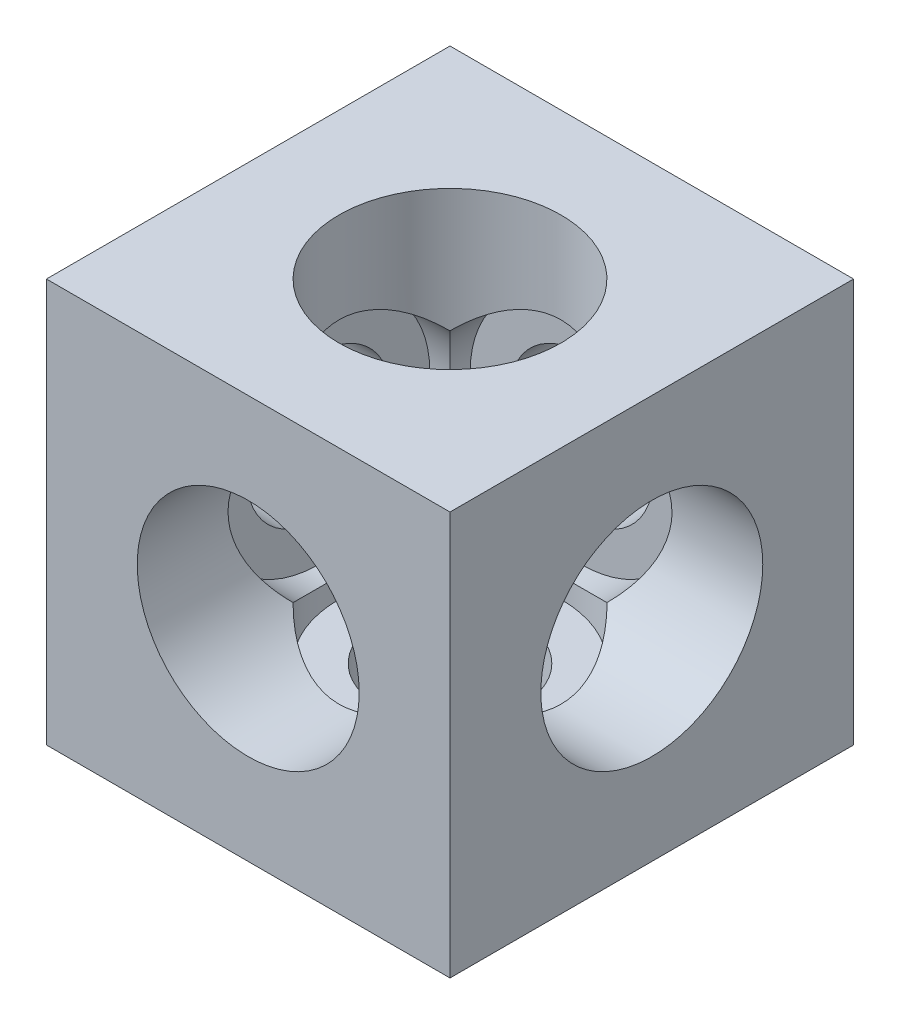
ISO-10303-21;
HEADER;
FILE_DESCRIPTION(('STEP AP214'),'2;1');
FILE_NAME('part.step','',(''),(''),'','','');
FILE_SCHEMA(('AUTOMOTIVE_DESIGN { 1 0 10303 214 1 1 1 1 }'));
ENDSEC;
DATA;
#1=APPLICATION_CONTEXT('core data for automotive mechanical design processes');
#2=APPLICATION_PROTOCOL_DEFINITION('international standard','automotive_design',2000,#1);
#3=PRODUCT_CONTEXT('',#1,'mechanical');
#4=PRODUCT('Part','Part','',(#3));
#5=PRODUCT_RELATED_PRODUCT_CATEGORY('part','',(#4));
#6=PRODUCT_DEFINITION_FORMATION('','',#4);
#7=PRODUCT_DEFINITION_CONTEXT('part definition',#1,'design');
#8=PRODUCT_DEFINITION('design','',#6,#7);
#9=PRODUCT_DEFINITION_SHAPE('','',#8);
#10=(LENGTH_UNIT() NAMED_UNIT(*) SI_UNIT(.MILLI.,.METRE.));
#11=(NAMED_UNIT(*) PLANE_ANGLE_UNIT() SI_UNIT($,.RADIAN.));
#12=(NAMED_UNIT(*) SI_UNIT($,.STERADIAN.) SOLID_ANGLE_UNIT());
#13=UNCERTAINTY_MEASURE_WITH_UNIT(LENGTH_MEASURE(1.E-05),#10,'distance_accuracy_value','');
#14=(GEOMETRIC_REPRESENTATION_CONTEXT(3) GLOBAL_UNCERTAINTY_ASSIGNED_CONTEXT((#13)) GLOBAL_UNIT_ASSIGNED_CONTEXT((#10,
#11,#12)) REPRESENTATION_CONTEXT('',''));
#15=CARTESIAN_POINT('',(0.,0.,0.));
#16=DIRECTION('',(0.,0.,1.));
#17=DIRECTION('',(1.,0.,0.));
#18=AXIS2_PLACEMENT_3D('',#15,#16,#17);
#19=CARTESIAN_POINT('',(0.,-10.,0.));
#20=DIRECTION('',(0.,1.,0.));
#21=DIRECTION('',(0.,0.,1.));
#22=AXIS2_PLACEMENT_3D('',#19,#20,#21);
#23=CYLINDRICAL_SURFACE('',#22,3.57);
#24=CARTESIAN_POINT('',(0.,-10.,0.));
#25=DIRECTION('',(0.,1.,0.));
#26=DIRECTION('',(0.,0.,1.));
#27=AXIS2_PLACEMENT_3D('',#24,#25,#26);
#28=CIRCLE('',#27,3.57);
#29=CARTESIAN_POINT('',(0.,-10.,3.57));
#30=VERTEX_POINT('',#29);
#31=EDGE_CURVE('E155',#30,#30,#28,.T.);
#32=ORIENTED_EDGE('',*,*,#31,.F.);
#33=EDGE_LOOP('',(#32));
#34=FACE_BOUND('',#33,.T.);
#35=CARTESIAN_POINT('',(0.,-6.50000000000001,0.));
#36=DIRECTION('',(0.,1.,0.));
#37=DIRECTION('',(-1.,0.,0.));
#38=AXIS2_PLACEMENT_3D('',#35,#36,#37);
#39=CIRCLE('',#38,3.57);
#40=CARTESIAN_POINT('',(-3.57,-6.50000000000001,0.));
#41=VERTEX_POINT('',#40);
#42=EDGE_CURVE('E133',#41,#41,#39,.F.);
#43=ORIENTED_EDGE('',*,*,#42,.F.);
#44=EDGE_LOOP('',(#43));
#45=FACE_BOUND('',#44,.T.);
#46=ADVANCED_FACE('F38',(#34,#45),#23,.F.);
#47=CARTESIAN_POINT('',(0.,0.,-25.556349186104));
#48=DIRECTION('',(0.,0.,1.));
#49=DIRECTION('',(1.,0.,0.));
#50=AXIS2_PLACEMENT_3D('',#47,#48,#49);
#51=CYLINDRICAL_SURFACE('',#50,5.5);
#52=CARTESIAN_POINT('',(0.,0.,10.));
#53=DIRECTION('',(0.,0.,1.));
#54=DIRECTION('',(1.,0.,0.));
#55=AXIS2_PLACEMENT_3D('',#52,#53,#54);
#56=CIRCLE('',#55,5.5);
#57=CARTESIAN_POINT('',(5.5,0.,10.));
#58=VERTEX_POINT('',#57);
#59=EDGE_CURVE('E169',#58,#58,#56,.T.);
#60=ORIENTED_EDGE('',*,*,#59,.T.);
#61=EDGE_LOOP('',(#60));
#62=FACE_BOUND('',#61,.T.);
#63=CARTESIAN_POINT('',(0.,0.,0.));
#64=DIRECTION('',(-0.707106781186547,0.,0.707106781186547));
#65=DIRECTION('',(0.707106781186547,0.,0.707106781186547));
#66=AXIS2_PLACEMENT_3D('',#63,#64,#65);
#67=ELLIPSE('',#66,7.77817459305202,5.5);
#68=CARTESIAN_POINT('',(3.88908729652601,3.88908729652601,3.88908729652601));
#69=VERTEX_POINT('',#68);
#70=CARTESIAN_POINT('',(3.88908729652601,-3.88908729652601,3.88908729652601));
#71=VERTEX_POINT('',#70);
#72=EDGE_CURVE('E112',#69,#71,#67,.F.);
#73=ORIENTED_EDGE('',*,*,#72,.T.);
#74=CARTESIAN_POINT('',(0.,0.,0.));
#75=DIRECTION('',(0.,0.707106781186547,0.707106781186547));
#76=DIRECTION('',(0.,-0.707106781186547,0.707106781186547));
#77=AXIS2_PLACEMENT_3D('',#74,#75,#76);
#78=ELLIPSE('',#77,7.77817459305202,5.5);
#79=CARTESIAN_POINT('',(-3.88908729652601,-3.88908729652601,3.88908729652601));
#80=VERTEX_POINT('',#79);
#81=EDGE_CURVE('E53',#71,#80,#78,.F.);
#82=ORIENTED_EDGE('',*,*,#81,.T.);
#83=CARTESIAN_POINT('',(0.,0.,0.));
#84=DIRECTION('',(0.707106781186547,0.,0.707106781186547));
#85=DIRECTION('',(-0.707106781186547,0.,0.707106781186547));
#86=AXIS2_PLACEMENT_3D('',#83,#84,#85);
#87=ELLIPSE('',#86,7.77817459305202,5.5);
#88=CARTESIAN_POINT('',(-3.88908729652601,3.88908729652601,3.88908729652601));
#89=VERTEX_POINT('',#88);
#90=EDGE_CURVE('E107',#80,#89,#87,.F.);
#91=ORIENTED_EDGE('',*,*,#90,.T.);
#92=CARTESIAN_POINT('',(0.,0.,0.));
#93=DIRECTION('',(0.,-0.707106781186547,0.707106781186547));
#94=DIRECTION('',(0.,0.707106781186547,0.707106781186547));
#95=AXIS2_PLACEMENT_3D('',#92,#93,#94);
#96=ELLIPSE('',#95,7.77817459305202,5.5);
#97=EDGE_CURVE('E101',#89,#69,#96,.F.);
#98=ORIENTED_EDGE('',*,*,#97,.T.);
#99=EDGE_LOOP('',(#73,#82,#91,#98));
#100=FACE_BOUND('',#99,.T.);
#101=ADVANCED_FACE('F111',(#62,#100),#51,.F.);
#102=CARTESIAN_POINT('',(-10.,0.,0.));
#103=DIRECTION('',(1.,0.,0.));
#104=DIRECTION('',(0.,0.,-1.));
#105=AXIS2_PLACEMENT_3D('',#102,#103,#104);
#106=CYLINDRICAL_SURFACE('',#105,3.57);
#107=CARTESIAN_POINT('',(-10.,0.,0.));
#108=DIRECTION('',(1.,0.,0.));
#109=DIRECTION('',(0.,0.,-1.));
#110=AXIS2_PLACEMENT_3D('',#107,#108,#109);
#111=CIRCLE('',#110,3.57);
#112=CARTESIAN_POINT('',(-10.,0.,-3.57));
#113=VERTEX_POINT('',#112);
#114=EDGE_CURVE('E165',#113,#113,#111,.T.);
#115=ORIENTED_EDGE('',*,*,#114,.F.);
#116=EDGE_LOOP('',(#115));
#117=FACE_BOUND('',#116,.T.);
#118=CARTESIAN_POINT('',(-6.5,0.,0.));
#119=DIRECTION('',(1.,0.,0.));
#120=DIRECTION('',(0.,0.,-1.));
#121=AXIS2_PLACEMENT_3D('',#118,#119,#120);
#122=CIRCLE('',#121,3.57);
#123=CARTESIAN_POINT('',(-6.5,0.,-3.57));
#124=VERTEX_POINT('',#123);
#125=EDGE_CURVE('E128',#124,#124,#122,.F.);
#126=ORIENTED_EDGE('',*,*,#125,.F.);
#127=EDGE_LOOP('',(#126));
#128=FACE_BOUND('',#127,.T.);
#129=ADVANCED_FACE('F233',(#117,#128),#106,.F.);
#130=CARTESIAN_POINT('',(9.99999999999999,-10.,10.));
#131=DIRECTION('',(-1.,0.,0.));
#132=DIRECTION('',(0.,0.,1.));
#133=AXIS2_PLACEMENT_3D('',#130,#131,#132);
#134=PLANE('',#133);
#135=CARTESIAN_POINT('',(9.99999999999999,0.,0.));
#136=DIRECTION('',(1.,0.,0.));
#137=DIRECTION('',(0.,0.,-1.));
#138=AXIS2_PLACEMENT_3D('',#135,#136,#137);
#139=CIRCLE('',#138,5.5);
#140=CARTESIAN_POINT('',(9.99999999999999,0.,-5.5));
#141=VERTEX_POINT('',#140);
#142=EDGE_CURVE('E158',#141,#141,#139,.T.);
#143=ORIENTED_EDGE('',*,*,#142,.F.);
#144=EDGE_LOOP('',(#143));
#145=FACE_BOUND('',#144,.T.);
#146=DIRECTION('',(0.,1.,0.));
#147=VECTOR('',#146,1.);
#148=CARTESIAN_POINT('',(9.99999999999999,-10.,-10.));
#149=LINE('',#148,#147);
#150=CARTESIAN_POINT('',(9.99999999999999,-10.,-10.));
#151=VERTEX_POINT('',#150);
#152=CARTESIAN_POINT('',(9.99999999999999,9.99999999999999,-10.));
#153=VERTEX_POINT('',#152);
#154=EDGE_CURVE('E181',#151,#153,#149,.T.);
#155=ORIENTED_EDGE('',*,*,#154,.T.);
#156=DIRECTION('',(0.,0.,-1.));
#157=VECTOR('',#156,1.);
#158=CARTESIAN_POINT('',(9.99999999999999,9.99999999999999,10.));
#159=LINE('',#158,#157);
#160=CARTESIAN_POINT('',(9.99999999999999,9.99999999999999,10.));
#161=VERTEX_POINT('',#160);
#162=EDGE_CURVE('E118',#161,#153,#159,.T.);
#163=ORIENTED_EDGE('',*,*,#162,.F.);
#164=DIRECTION('',(0.,1.,0.));
#165=VECTOR('',#164,1.);
#166=CARTESIAN_POINT('',(9.99999999999999,-10.,10.));
#167=LINE('',#166,#165);
#168=CARTESIAN_POINT('',(9.99999999999999,-10.,10.));
#169=VERTEX_POINT('',#168);
#170=EDGE_CURVE('E182',#169,#161,#167,.T.);
#171=ORIENTED_EDGE('',*,*,#170,.F.);
#172=DIRECTION('',(0.,0.,-1.));
#173=VECTOR('',#172,1.);
#174=CARTESIAN_POINT('',(9.99999999999999,-10.,10.));
#175=LINE('',#174,#173);
#176=EDGE_CURVE('E192',#169,#151,#175,.T.);
#177=ORIENTED_EDGE('',*,*,#176,.T.);
#178=EDGE_LOOP('',(#155,#163,#171,#177));
#179=FACE_BOUND('',#178,.T.);
#180=ADVANCED_FACE('F40',(#145,#179),#134,.F.);
#181=CARTESIAN_POINT('',(-10.,9.99999999999999,10.));
#182=DIRECTION('',(0.,-1.,0.));
#183=DIRECTION('',(0.,0.,-1.));
#184=AXIS2_PLACEMENT_3D('',#181,#182,#183);
#185=PLANE('',#184);
#186=CARTESIAN_POINT('',(0.,9.99999999999999,0.));
#187=DIRECTION('',(0.,1.,0.));
#188=DIRECTION('',(0.,0.,1.));
#189=AXIS2_PLACEMENT_3D('',#186,#187,#188);
#190=CIRCLE('',#189,5.5);
#191=CARTESIAN_POINT('',(0.,9.99999999999999,5.5));
#192=VERTEX_POINT('',#191);
#193=EDGE_CURVE('E140',#192,#192,#190,.T.);
#194=ORIENTED_EDGE('',*,*,#193,.F.);
#195=EDGE_LOOP('',(#194));
#196=FACE_BOUND('',#195,.T.);
#197=DIRECTION('',(-1.,0.,0.));
#198=VECTOR('',#197,1.);
#199=CARTESIAN_POINT('',(-10.,9.99999999999999,-10.));
#200=LINE('',#199,#198);
#201=CARTESIAN_POINT('',(-10.,9.99999999999999,-10.));
#202=VERTEX_POINT('',#201);
#203=EDGE_CURVE('E195',#153,#202,#200,.T.);
#204=ORIENTED_EDGE('',*,*,#203,.T.);
#205=DIRECTION('',(0.,0.,-1.));
#206=VECTOR('',#205,1.);
#207=CARTESIAN_POINT('',(-10.,9.99999999999999,10.));
#208=LINE('',#207,#206);
#209=CARTESIAN_POINT('',(-10.,9.99999999999999,10.));
#210=VERTEX_POINT('',#209);
#211=EDGE_CURVE('E125',#210,#202,#208,.T.);
#212=ORIENTED_EDGE('',*,*,#211,.F.);
#213=DIRECTION('',(-1.,0.,0.));
#214=VECTOR('',#213,1.);
#215=CARTESIAN_POINT('',(-10.,9.99999999999999,10.));
#216=LINE('',#215,#214);
#217=EDGE_CURVE('E185',#161,#210,#216,.T.);
#218=ORIENTED_EDGE('',*,*,#217,.F.);
#219=ORIENTED_EDGE('',*,*,#162,.T.);
#220=EDGE_LOOP('',(#204,#212,#218,#219));
#221=FACE_BOUND('',#220,.T.);
#222=ADVANCED_FACE('F253',(#196,#221),#185,.F.);
#223=CARTESIAN_POINT('',(-10.,-10.,10.));
#224=DIRECTION('',(1.,0.,0.));
#225=DIRECTION('',(0.,0.,-1.));
#226=AXIS2_PLACEMENT_3D('',#223,#224,#225);
#227=PLANE('',#226);
#228=ORIENTED_EDGE('',*,*,#114,.T.);
#229=EDGE_LOOP('',(#228));
#230=FACE_BOUND('',#229,.T.);
#231=DIRECTION('',(0.,-1.,0.));
#232=VECTOR('',#231,1.);
#233=CARTESIAN_POINT('',(-10.,-10.,-10.));
#234=LINE('',#233,#232);
#235=CARTESIAN_POINT('',(-10.,-10.,-10.));
#236=VERTEX_POINT('',#235);
#237=EDGE_CURVE('E197',#202,#236,#234,.T.);
#238=ORIENTED_EDGE('',*,*,#237,.T.);
#239=DIRECTION('',(0.,0.,-1.));
#240=VECTOR('',#239,1.);
#241=CARTESIAN_POINT('',(-10.,-10.,10.));
#242=LINE('',#241,#240);
#243=CARTESIAN_POINT('',(-10.,-10.,10.));
#244=VERTEX_POINT('',#243);
#245=EDGE_CURVE('E202',#244,#236,#242,.T.);
#246=ORIENTED_EDGE('',*,*,#245,.F.);
#247=DIRECTION('',(0.,-1.,0.));
#248=VECTOR('',#247,1.);
#249=CARTESIAN_POINT('',(-10.,-10.,10.));
#250=LINE('',#249,#248);
#251=EDGE_CURVE('E188',#210,#244,#250,.T.);
#252=ORIENTED_EDGE('',*,*,#251,.F.);
#253=ORIENTED_EDGE('',*,*,#211,.T.);
#254=EDGE_LOOP('',(#238,#246,#252,#253));
#255=FACE_BOUND('',#254,.T.);
#256=ADVANCED_FACE('F261',(#230,#255),#227,.F.);
#257=CARTESIAN_POINT('',(-10.,-10.,10.));
#258=DIRECTION('',(0.,1.,0.));
#259=DIRECTION('',(-1.,0.,0.));
#260=AXIS2_PLACEMENT_3D('',#257,#258,#259);
#261=PLANE('',#260);
#262=ORIENTED_EDGE('',*,*,#31,.T.);
#263=EDGE_LOOP('',(#262));
#264=FACE_BOUND('',#263,.T.);
#265=DIRECTION('',(1.,0.,0.));
#266=VECTOR('',#265,1.);
#267=CARTESIAN_POINT('',(-10.,-10.,-10.));
#268=LINE('',#267,#266);
#269=EDGE_CURVE('E186',#236,#151,#268,.T.);
#270=ORIENTED_EDGE('',*,*,#269,.T.);
#271=ORIENTED_EDGE('',*,*,#176,.F.);
#272=DIRECTION('',(1.,0.,0.));
#273=VECTOR('',#272,1.);
#274=CARTESIAN_POINT('',(-10.,-10.,10.));
#275=LINE('',#274,#273);
#276=EDGE_CURVE('E190',#244,#169,#275,.T.);
#277=ORIENTED_EDGE('',*,*,#276,.F.);
#278=ORIENTED_EDGE('',*,*,#245,.T.);
#279=EDGE_LOOP('',(#270,#271,#277,#278));
#280=FACE_BOUND('',#279,.T.);
#281=ADVANCED_FACE('F264',(#264,#280),#261,.F.);
#282=CARTESIAN_POINT('',(9.99999999999999,9.99999999999999,10.));
#283=DIRECTION('',(0.,0.,-1.));
#284=DIRECTION('',(-1.,0.,0.));
#285=AXIS2_PLACEMENT_3D('',#282,#283,#284);
#286=PLANE('',#285);
#287=ORIENTED_EDGE('',*,*,#59,.F.);
#288=EDGE_LOOP('',(#287));
#289=FACE_BOUND('',#288,.T.);
#290=ORIENTED_EDGE('',*,*,#170,.T.);
#291=ORIENTED_EDGE('',*,*,#217,.T.);
#292=ORIENTED_EDGE('',*,*,#251,.T.);
#293=ORIENTED_EDGE('',*,*,#276,.T.);
#294=EDGE_LOOP('',(#290,#291,#292,#293));
#295=FACE_BOUND('',#294,.T.);
#296=ADVANCED_FACE('F280',(#289,#295),#286,.F.);
#297=CARTESIAN_POINT('',(9.99999999999999,9.99999999999999,-10.));
#298=DIRECTION('',(0.,0.,-1.));
#299=DIRECTION('',(-1.,0.,0.));
#300=AXIS2_PLACEMENT_3D('',#297,#298,#299);
#301=PLANE('',#300);
#302=CARTESIAN_POINT('',(0.,0.,-10.));
#303=DIRECTION('',(0.,0.,1.));
#304=DIRECTION('',(1.,0.,0.));
#305=AXIS2_PLACEMENT_3D('',#302,#303,#304);
#306=CIRCLE('',#305,3.57);
#307=CARTESIAN_POINT('',(3.57,0.,-10.));
#308=VERTEX_POINT('',#307);
#309=EDGE_CURVE('E177',#308,#308,#306,.T.);
#310=ORIENTED_EDGE('',*,*,#309,.T.);
#311=EDGE_LOOP('',(#310));
#312=FACE_BOUND('',#311,.T.);
#313=ORIENTED_EDGE('',*,*,#154,.F.);
#314=ORIENTED_EDGE('',*,*,#269,.F.);
#315=ORIENTED_EDGE('',*,*,#237,.F.);
#316=ORIENTED_EDGE('',*,*,#203,.F.);
#317=EDGE_LOOP('',(#313,#314,#315,#316));
#318=FACE_BOUND('',#317,.T.);
#319=ADVANCED_FACE('F225',(#312,#318),#301,.T.);
#320=CARTESIAN_POINT('',(0.,0.,-10.));
#321=DIRECTION('',(0.,0.,1.));
#322=DIRECTION('',(1.,0.,0.));
#323=AXIS2_PLACEMENT_3D('',#320,#321,#322);
#324=CYLINDRICAL_SURFACE('',#323,3.57);
#325=CARTESIAN_POINT('',(0.,0.,-6.5));
#326=DIRECTION('',(0.,0.,-1.));
#327=DIRECTION('',(-1.,0.,0.));
#328=AXIS2_PLACEMENT_3D('',#325,#326,#327);
#329=CIRCLE('',#328,3.57);
#330=CARTESIAN_POINT('',(-3.57,0.,-6.5));
#331=VERTEX_POINT('',#330);
#332=EDGE_CURVE('E176',#331,#331,#329,.F.);
#333=ORIENTED_EDGE('',*,*,#332,.T.);
#334=EDGE_LOOP('',(#333));
#335=FACE_BOUND('',#334,.T.);
#336=ORIENTED_EDGE('',*,*,#309,.F.);
#337=EDGE_LOOP('',(#336));
#338=FACE_BOUND('',#337,.T.);
#339=ADVANCED_FACE('F210',(#335,#338),#324,.F.);
#340=CARTESIAN_POINT('',(9.99999999999999,9.99999999999999,-6.5));
#341=DIRECTION('',(0.,0.,-1.));
#342=DIRECTION('',(-1.,0.,0.));
#343=AXIS2_PLACEMENT_3D('',#340,#341,#342);
#344=PLANE('',#343);
#345=CARTESIAN_POINT('',(0.,0.,-6.5));
#346=DIRECTION('',(0.,0.,-1.));
#347=DIRECTION('',(-1.,0.,0.));
#348=AXIS2_PLACEMENT_3D('',#345,#346,#347);
#349=CIRCLE('',#348,5.5);
#350=CARTESIAN_POINT('',(-5.5,0.,-6.5));
#351=VERTEX_POINT('',#350);
#352=EDGE_CURVE('E172',#351,#351,#349,.F.);
#353=ORIENTED_EDGE('',*,*,#352,.T.);
#354=EDGE_LOOP('',(#353));
#355=FACE_BOUND('',#354,.T.);
#356=ORIENTED_EDGE('',*,*,#332,.F.);
#357=EDGE_LOOP('',(#356));
#358=FACE_BOUND('',#357,.T.);
#359=ADVANCED_FACE('F213',(#355,#358),#344,.F.);
#360=CARTESIAN_POINT('',(0.,0.,0.));
#361=DIRECTION('',(0.707106781186547,0.,0.707106781186547));
#362=DIRECTION('',(-0.707106781186547,0.,0.707106781186547));
#363=AXIS2_PLACEMENT_3D('',#360,#361,#362);
#364=ELLIPSE('',#363,7.77817459305202,5.5);
#365=CARTESIAN_POINT('',(3.88908729652601,-3.88908729652601,-3.88908729652601));
#366=VERTEX_POINT('',#365);
#367=CARTESIAN_POINT('',(3.88908729652601,3.88908729652601,-3.88908729652601));
#368=VERTEX_POINT('',#367);
#369=EDGE_CURVE('E122',#366,#368,#364,.T.);
#370=ORIENTED_EDGE('',*,*,#369,.T.);
#371=CARTESIAN_POINT('',(0.,0.,0.));
#372=DIRECTION('',(0.,0.707106781186547,0.707106781186547));
#373=DIRECTION('',(0.,-0.707106781186547,0.707106781186547));
#374=AXIS2_PLACEMENT_3D('',#371,#372,#373);
#375=ELLIPSE('',#374,7.77817459305202,5.5);
#376=CARTESIAN_POINT('',(-3.88908729652601,3.88908729652601,-3.88908729652601));
#377=VERTEX_POINT('',#376);
#378=EDGE_CURVE('E60',#368,#377,#375,.T.);
#379=ORIENTED_EDGE('',*,*,#378,.T.);
#380=CARTESIAN_POINT('',(0.,0.,0.));
#381=DIRECTION('',(-0.707106781186547,0.,0.707106781186547));
#382=DIRECTION('',(0.707106781186547,0.,0.707106781186547));
#383=AXIS2_PLACEMENT_3D('',#380,#381,#382);
#384=ELLIPSE('',#383,7.77817459305202,5.5);
#385=CARTESIAN_POINT('',(-3.88908729652601,-3.88908729652601,-3.88908729652601));
#386=VERTEX_POINT('',#385);
#387=EDGE_CURVE('E117',#377,#386,#384,.T.);
#388=ORIENTED_EDGE('',*,*,#387,.T.);
#389=CARTESIAN_POINT('',(0.,0.,0.));
#390=DIRECTION('',(0.,-0.707106781186547,0.707106781186547));
#391=DIRECTION('',(0.,0.707106781186547,0.707106781186547));
#392=AXIS2_PLACEMENT_3D('',#389,#390,#391);
#393=ELLIPSE('',#392,7.77817459305202,5.5);
#394=EDGE_CURVE('E148',#386,#366,#393,.T.);
#395=ORIENTED_EDGE('',*,*,#394,.T.);
#396=EDGE_LOOP('',(#370,#379,#388,#395));
#397=FACE_BOUND('',#396,.T.);
#398=ORIENTED_EDGE('',*,*,#352,.F.);
#399=EDGE_LOOP('',(#398));
#400=FACE_BOUND('',#399,.T.);
#401=ADVANCED_FACE('F215',(#397,#400),#51,.F.);
#402=CARTESIAN_POINT('',(-6.5,-10.,10.));
#403=DIRECTION('',(1.,0.,0.));
#404=DIRECTION('',(0.,0.,-1.));
#405=AXIS2_PLACEMENT_3D('',#402,#403,#404);
#406=PLANE('',#405);
#407=CARTESIAN_POINT('',(-6.5,0.,0.));
#408=DIRECTION('',(1.,0.,0.));
#409=DIRECTION('',(0.,0.,-1.));
#410=AXIS2_PLACEMENT_3D('',#407,#408,#409);
#411=CIRCLE('',#410,5.5);
#412=CARTESIAN_POINT('',(-6.5,0.,-5.5));
#413=VERTEX_POINT('',#412);
#414=EDGE_CURVE('E161',#413,#413,#411,.F.);
#415=ORIENTED_EDGE('',*,*,#414,.F.);
#416=EDGE_LOOP('',(#415));
#417=FACE_BOUND('',#416,.T.);
#418=ORIENTED_EDGE('',*,*,#125,.T.);
#419=EDGE_LOOP('',(#418));
#420=FACE_BOUND('',#419,.T.);
#421=ADVANCED_FACE('F222',(#417,#420),#406,.T.);
#422=CARTESIAN_POINT('',(-25.556349186104,0.,0.));
#423=DIRECTION('',(1.,0.,0.));
#424=DIRECTION('',(0.,0.,-1.));
#425=AXIS2_PLACEMENT_3D('',#422,#423,#424);
#426=CYLINDRICAL_SURFACE('',#425,5.5);
#427=ORIENTED_EDGE('',*,*,#414,.T.);
#428=EDGE_LOOP('',(#427));
#429=FACE_BOUND('',#428,.T.);
#430=ORIENTED_EDGE('',*,*,#387,.F.);
#431=CARTESIAN_POINT('',(0.,0.,0.));
#432=DIRECTION('',(0.707106781186547,0.707106781186547,0.));
#433=DIRECTION('',(0.707106781186547,-0.707106781186547,0.));
#434=AXIS2_PLACEMENT_3D('',#431,#432,#433);
#435=ELLIPSE('',#434,7.77817459305202,5.5);
#436=EDGE_CURVE('E114',#377,#89,#435,.T.);
#437=ORIENTED_EDGE('',*,*,#436,.T.);
#438=ORIENTED_EDGE('',*,*,#90,.F.);
#439=CARTESIAN_POINT('',(0.,0.,0.));
#440=DIRECTION('',(0.707106781186547,-0.707106781186547,0.));
#441=DIRECTION('',(0.707106781186547,0.707106781186547,0.));
#442=AXIS2_PLACEMENT_3D('',#439,#440,#441);
#443=ELLIPSE('',#442,7.77817459305202,5.5);
#444=EDGE_CURVE('E152',#80,#386,#443,.T.);
#445=ORIENTED_EDGE('',*,*,#444,.T.);
#446=EDGE_LOOP('',(#430,#437,#438,#445));
#447=FACE_BOUND('',#446,.T.);
#448=ADVANCED_FACE('F243',(#429,#447),#426,.F.);
#449=ORIENTED_EDGE('',*,*,#142,.T.);
#450=EDGE_LOOP('',(#449));
#451=FACE_BOUND('',#450,.T.);
#452=ORIENTED_EDGE('',*,*,#369,.F.);
#453=CARTESIAN_POINT('',(0.,0.,0.));
#454=DIRECTION('',(0.707106781186547,0.707106781186547,0.));
#455=DIRECTION('',(0.707106781186547,-0.707106781186547,0.));
#456=AXIS2_PLACEMENT_3D('',#453,#454,#455);
#457=ELLIPSE('',#456,7.77817459305202,5.5);
#458=EDGE_CURVE('E12',#366,#71,#457,.F.);
#459=ORIENTED_EDGE('',*,*,#458,.T.);
#460=ORIENTED_EDGE('',*,*,#72,.F.);
#461=CARTESIAN_POINT('',(0.,0.,0.));
#462=DIRECTION('',(0.707106781186547,-0.707106781186547,0.));
#463=DIRECTION('',(0.707106781186547,0.707106781186547,0.));
#464=AXIS2_PLACEMENT_3D('',#461,#462,#463);
#465=ELLIPSE('',#464,7.77817459305202,5.5);
#466=EDGE_CURVE('E46',#69,#368,#465,.F.);
#467=ORIENTED_EDGE('',*,*,#466,.T.);
#468=EDGE_LOOP('',(#452,#459,#460,#467));
#469=FACE_BOUND('',#468,.T.);
#470=ADVANCED_FACE('F116',(#451,#469),#426,.F.);
#471=CARTESIAN_POINT('',(-10.,-6.5,10.));
#472=DIRECTION('',(0.,1.,0.));
#473=DIRECTION('',(-1.,0.,0.));
#474=AXIS2_PLACEMENT_3D('',#471,#472,#473);
#475=PLANE('',#474);
#476=CARTESIAN_POINT('',(0.,-6.50000000000001,0.));
#477=DIRECTION('',(0.,1.,0.));
#478=DIRECTION('',(-1.,0.,0.));
#479=AXIS2_PLACEMENT_3D('',#476,#477,#478);
#480=CIRCLE('',#479,5.5);
#481=CARTESIAN_POINT('',(-5.5,-6.5,0.));
#482=VERTEX_POINT('',#481);
#483=EDGE_CURVE('E135',#482,#482,#480,.F.);
#484=ORIENTED_EDGE('',*,*,#483,.F.);
#485=EDGE_LOOP('',(#484));
#486=FACE_BOUND('',#485,.T.);
#487=ORIENTED_EDGE('',*,*,#42,.T.);
#488=EDGE_LOOP('',(#487));
#489=FACE_BOUND('',#488,.T.);
#490=ADVANCED_FACE('F373',(#486,#489),#475,.T.);
#491=CARTESIAN_POINT('',(0.,-25.5563491861041,0.));
#492=DIRECTION('',(0.,1.,0.));
#493=DIRECTION('',(0.,0.,1.));
#494=AXIS2_PLACEMENT_3D('',#491,#492,#493);
#495=CYLINDRICAL_SURFACE('',#494,5.5);
#496=ORIENTED_EDGE('',*,*,#483,.T.);
#497=EDGE_LOOP('',(#496));
#498=FACE_BOUND('',#497,.T.);
#499=ORIENTED_EDGE('',*,*,#81,.F.);
#500=ORIENTED_EDGE('',*,*,#458,.F.);
#501=ORIENTED_EDGE('',*,*,#394,.F.);
#502=ORIENTED_EDGE('',*,*,#444,.F.);
#503=EDGE_LOOP('',(#499,#500,#501,#502));
#504=FACE_BOUND('',#503,.T.);
#505=ADVANCED_FACE('F239',(#498,#504),#495,.F.);
#506=ORIENTED_EDGE('',*,*,#193,.T.);
#507=EDGE_LOOP('',(#506));
#508=FACE_BOUND('',#507,.T.);
#509=ORIENTED_EDGE('',*,*,#378,.F.);
#510=ORIENTED_EDGE('',*,*,#466,.F.);
#511=ORIENTED_EDGE('',*,*,#97,.F.);
#512=ORIENTED_EDGE('',*,*,#436,.F.);
#513=EDGE_LOOP('',(#509,#510,#511,#512));
#514=FACE_BOUND('',#513,.T.);
#515=ADVANCED_FACE('F100',(#508,#514),#495,.F.);
#516=CLOSED_SHELL('',(#46,#101,#129,#180,#222,#256,#281,#296,#319,#339,#359,#401,#421,#448,#470,
#490,#505,#515));
#517=MANIFOLD_SOLID_BREP('B2',#516);
#518=ADVANCED_BREP_SHAPE_REPRESENTATION('',(#18,#517),#14);
#519=SHAPE_DEFINITION_REPRESENTATION(#9,#518);
ENDSEC;
END-ISO-10303-21;
